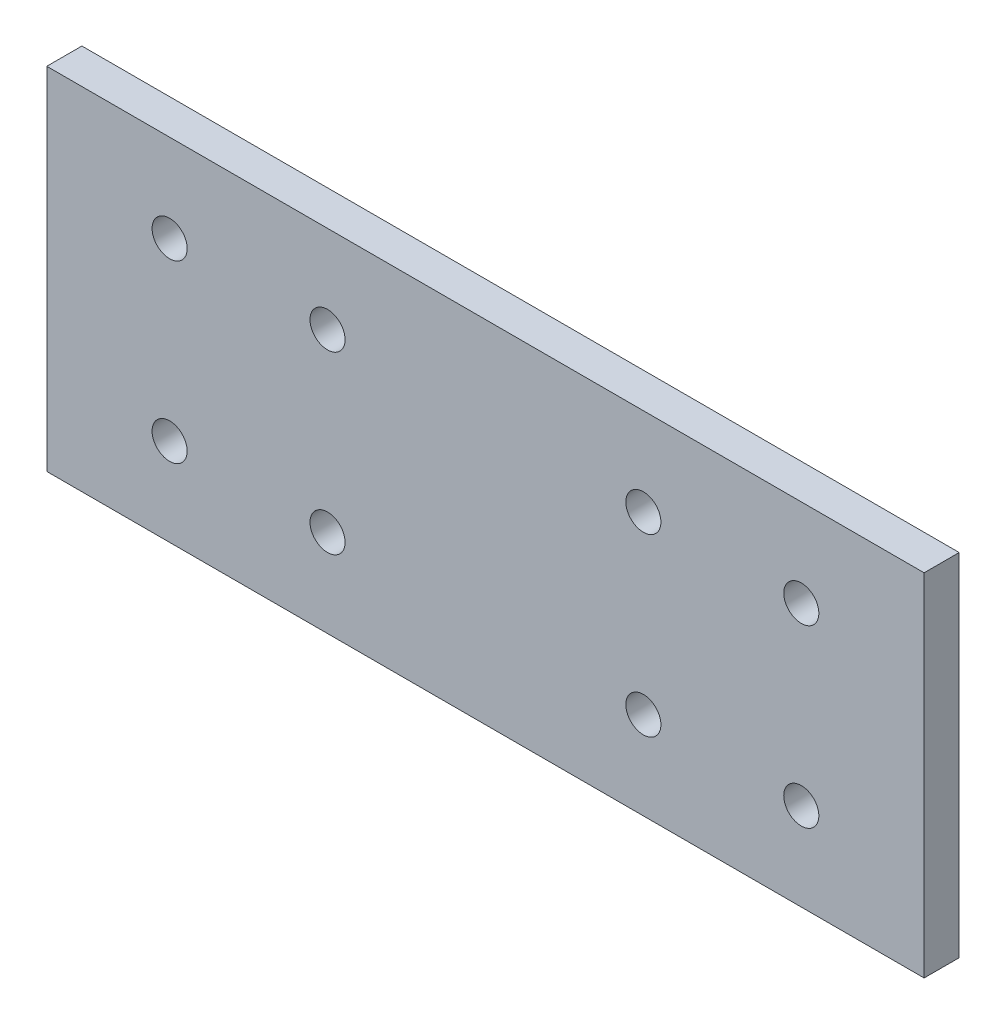
ISO-10303-21;
HEADER;
FILE_DESCRIPTION(('STEP AP214'),'2;1');
FILE_NAME('part.step','',(''),(''),'','','');
FILE_SCHEMA(('AUTOMOTIVE_DESIGN { 1 0 10303 214 1 1 1 1 }'));
ENDSEC;
DATA;
#1=APPLICATION_CONTEXT('core data for automotive mechanical design processes');
#2=APPLICATION_PROTOCOL_DEFINITION('international standard','automotive_design',2000,#1);
#3=PRODUCT_CONTEXT('',#1,'mechanical');
#4=PRODUCT('Part','Part','',(#3));
#5=PRODUCT_RELATED_PRODUCT_CATEGORY('part','',(#4));
#6=PRODUCT_DEFINITION_FORMATION('','',#4);
#7=PRODUCT_DEFINITION_CONTEXT('part definition',#1,'design');
#8=PRODUCT_DEFINITION('design','',#6,#7);
#9=PRODUCT_DEFINITION_SHAPE('','',#8);
#10=(LENGTH_UNIT() NAMED_UNIT(*) SI_UNIT(.MILLI.,.METRE.));
#11=(NAMED_UNIT(*) PLANE_ANGLE_UNIT() SI_UNIT($,.RADIAN.));
#12=(NAMED_UNIT(*) SI_UNIT($,.STERADIAN.) SOLID_ANGLE_UNIT());
#13=UNCERTAINTY_MEASURE_WITH_UNIT(LENGTH_MEASURE(1.E-05),#10,'distance_accuracy_value','');
#14=(GEOMETRIC_REPRESENTATION_CONTEXT(3) GLOBAL_UNCERTAINTY_ASSIGNED_CONTEXT((#13)) GLOBAL_UNIT_ASSIGNED_CONTEXT((#10,
#11,#12)) REPRESENTATION_CONTEXT('',''));
#15=CARTESIAN_POINT('',(0.,0.,0.));
#16=DIRECTION('',(0.,0.,1.));
#17=DIRECTION('',(1.,0.,0.));
#18=AXIS2_PLACEMENT_3D('',#15,#16,#17);
#19=CARTESIAN_POINT('',(0.,0.,0.));
#20=DIRECTION('',(0.,0.,1.));
#21=DIRECTION('',(1.,0.,0.));
#22=AXIS2_PLACEMENT_3D('',#19,#20,#21);
#23=PLANE('',#22);
#24=CARTESIAN_POINT('',(-180.,-50.,0.));
#25=DIRECTION('',(0.,0.,-1.));
#26=DIRECTION('',(0.,1.,0.));
#27=AXIS2_PLACEMENT_3D('',#24,#25,#26);
#28=CIRCLE('',#27,10.);
#29=CARTESIAN_POINT('',(-180.,-40.,0.));
#30=VERTEX_POINT('',#29);
#31=EDGE_CURVE('E103',#30,#30,#28,.F.);
#32=ORIENTED_EDGE('',*,*,#31,.T.);
#33=EDGE_LOOP('',(#32));
#34=FACE_BOUND('',#33,.T.);
#35=CARTESIAN_POINT('',(-90.,-50.,0.));
#36=DIRECTION('',(0.,0.,-1.));
#37=DIRECTION('',(0.,1.,0.));
#38=AXIS2_PLACEMENT_3D('',#35,#36,#37);
#39=CIRCLE('',#38,10.);
#40=CARTESIAN_POINT('',(-90.,-40.,0.));
#41=VERTEX_POINT('',#40);
#42=EDGE_CURVE('E107',#41,#41,#39,.F.);
#43=ORIENTED_EDGE('',*,*,#42,.T.);
#44=EDGE_LOOP('',(#43));
#45=FACE_BOUND('',#44,.T.);
#46=CARTESIAN_POINT('',(-180.,50.,0.));
#47=DIRECTION('',(0.,0.,-1.));
#48=DIRECTION('',(0.,1.,0.));
#49=AXIS2_PLACEMENT_3D('',#46,#47,#48);
#50=CIRCLE('',#49,10.);
#51=CARTESIAN_POINT('',(-180.,60.,0.));
#52=VERTEX_POINT('',#51);
#53=EDGE_CURVE('E110',#52,#52,#50,.F.);
#54=ORIENTED_EDGE('',*,*,#53,.T.);
#55=EDGE_LOOP('',(#54));
#56=FACE_BOUND('',#55,.T.);
#57=CARTESIAN_POINT('',(-90.,50.,0.));
#58=DIRECTION('',(0.,0.,-1.));
#59=DIRECTION('',(0.,1.,0.));
#60=AXIS2_PLACEMENT_3D('',#57,#58,#59);
#61=CIRCLE('',#60,10.);
#62=CARTESIAN_POINT('',(-90.,60.0000000000001,0.));
#63=VERTEX_POINT('',#62);
#64=EDGE_CURVE('E113',#63,#63,#61,.F.);
#65=ORIENTED_EDGE('',*,*,#64,.T.);
#66=EDGE_LOOP('',(#65));
#67=FACE_BOUND('',#66,.T.);
#68=CARTESIAN_POINT('',(90.,-50.,0.));
#69=DIRECTION('',(0.,0.,-1.));
#70=DIRECTION('',(-1.,0.,0.));
#71=AXIS2_PLACEMENT_3D('',#68,#69,#70);
#72=CIRCLE('',#71,9.99999999999999);
#73=CARTESIAN_POINT('',(80.,-50.,0.));
#74=VERTEX_POINT('',#73);
#75=EDGE_CURVE('E116',#74,#74,#72,.F.);
#76=ORIENTED_EDGE('',*,*,#75,.T.);
#77=EDGE_LOOP('',(#76));
#78=FACE_BOUND('',#77,.T.);
#79=CARTESIAN_POINT('',(180.,-50.,0.));
#80=DIRECTION('',(0.,0.,-1.));
#81=DIRECTION('',(-1.,0.,0.));
#82=AXIS2_PLACEMENT_3D('',#79,#80,#81);
#83=CIRCLE('',#82,9.99999999999999);
#84=CARTESIAN_POINT('',(170.,-50.,0.));
#85=VERTEX_POINT('',#84);
#86=EDGE_CURVE('E119',#85,#85,#83,.F.);
#87=ORIENTED_EDGE('',*,*,#86,.T.);
#88=EDGE_LOOP('',(#87));
#89=FACE_BOUND('',#88,.T.);
#90=CARTESIAN_POINT('',(90.,50.,0.));
#91=DIRECTION('',(0.,0.,-1.));
#92=DIRECTION('',(-1.,0.,0.));
#93=AXIS2_PLACEMENT_3D('',#90,#91,#92);
#94=CIRCLE('',#93,9.99999999999999);
#95=CARTESIAN_POINT('',(80.,50.,0.));
#96=VERTEX_POINT('',#95);
#97=EDGE_CURVE('E121',#96,#96,#94,.F.);
#98=ORIENTED_EDGE('',*,*,#97,.T.);
#99=EDGE_LOOP('',(#98));
#100=FACE_BOUND('',#99,.T.);
#101=CARTESIAN_POINT('',(180.,50.,0.));
#102=DIRECTION('',(0.,0.,-1.));
#103=DIRECTION('',(-1.,0.,0.));
#104=AXIS2_PLACEMENT_3D('',#101,#102,#103);
#105=CIRCLE('',#104,9.99999999999999);
#106=CARTESIAN_POINT('',(170.,50.,0.));
#107=VERTEX_POINT('',#106);
#108=EDGE_CURVE('E21',#107,#107,#105,.F.);
#109=ORIENTED_EDGE('',*,*,#108,.T.);
#110=EDGE_LOOP('',(#109));
#111=FACE_BOUND('',#110,.T.);
#112=DIRECTION('',(0.,1.,0.));
#113=VECTOR('',#112,1.);
#114=CARTESIAN_POINT('',(250.,100.,0.));
#115=LINE('',#114,#113);
#116=CARTESIAN_POINT('',(250.,-100.,0.));
#117=VERTEX_POINT('',#116);
#118=CARTESIAN_POINT('',(250.,100.,0.));
#119=VERTEX_POINT('',#118);
#120=EDGE_CURVE('E61',#117,#119,#115,.T.);
#121=ORIENTED_EDGE('',*,*,#120,.F.);
#122=DIRECTION('',(1.,0.,0.));
#123=VECTOR('',#122,1.);
#124=CARTESIAN_POINT('',(250.,-99.9999999999999,0.));
#125=LINE('',#124,#123);
#126=CARTESIAN_POINT('',(-250.,-100.,0.));
#127=VERTEX_POINT('',#126);
#128=EDGE_CURVE('E128',#127,#117,#125,.T.);
#129=ORIENTED_EDGE('',*,*,#128,.F.);
#130=DIRECTION('',(0.,1.,0.));
#131=VECTOR('',#130,1.);
#132=CARTESIAN_POINT('',(-250.,-100.,0.));
#133=LINE('',#132,#131);
#134=CARTESIAN_POINT('',(-250.,100.,0.));
#135=VERTEX_POINT('',#134);
#136=EDGE_CURVE('E71',#135,#127,#133,.F.);
#137=ORIENTED_EDGE('',*,*,#136,.F.);
#138=DIRECTION('',(1.,0.,0.));
#139=VECTOR('',#138,1.);
#140=CARTESIAN_POINT('',(-250.,100.,0.));
#141=LINE('',#140,#139);
#142=EDGE_CURVE('E56',#119,#135,#141,.F.);
#143=ORIENTED_EDGE('',*,*,#142,.F.);
#144=EDGE_LOOP('',(#121,#129,#137,#143));
#145=FACE_BOUND('',#144,.T.);
#146=ADVANCED_FACE('F17',(#34,#45,#56,#67,#78,#89,#100,#111,#145),#23,.F.);
#147=CARTESIAN_POINT('',(250.,100.,0.));
#148=DIRECTION('',(1.,0.,0.));
#149=DIRECTION('',(0.,0.,-1.));
#150=AXIS2_PLACEMENT_3D('',#147,#148,#149);
#151=PLANE('',#150);
#152=ORIENTED_EDGE('',*,*,#120,.T.);
#153=DIRECTION('',(0.,0.,1.));
#154=VECTOR('',#153,1.);
#155=CARTESIAN_POINT('',(250.,100.,0.));
#156=LINE('',#155,#154);
#157=CARTESIAN_POINT('',(250.,100.,20.));
#158=VERTEX_POINT('',#157);
#159=EDGE_CURVE('E63',#158,#119,#156,.F.);
#160=ORIENTED_EDGE('',*,*,#159,.F.);
#161=DIRECTION('',(0.,1.,0.));
#162=VECTOR('',#161,1.);
#163=CARTESIAN_POINT('',(250.,0.,20.));
#164=LINE('',#163,#162);
#165=CARTESIAN_POINT('',(250.,-100.,20.));
#166=VERTEX_POINT('',#165);
#167=EDGE_CURVE('E106',#166,#158,#164,.T.);
#168=ORIENTED_EDGE('',*,*,#167,.F.);
#169=DIRECTION('',(0.,0.,-1.));
#170=VECTOR('',#169,1.);
#171=CARTESIAN_POINT('',(250.,-99.9999999999999,0.));
#172=LINE('',#171,#170);
#173=EDGE_CURVE('E66',#117,#166,#172,.F.);
#174=ORIENTED_EDGE('',*,*,#173,.F.);
#175=EDGE_LOOP('',(#152,#160,#168,#174));
#176=FACE_BOUND('',#175,.T.);
#177=ADVANCED_FACE('F62',(#176),#151,.T.);
#178=CARTESIAN_POINT('',(-250.,100.,0.));
#179=DIRECTION('',(0.,1.,0.));
#180=DIRECTION('',(0.,0.,1.));
#181=AXIS2_PLACEMENT_3D('',#178,#179,#180);
#182=PLANE('',#181);
#183=ORIENTED_EDGE('',*,*,#142,.T.);
#184=DIRECTION('',(0.,0.,1.));
#185=VECTOR('',#184,1.);
#186=CARTESIAN_POINT('',(-250.,100.,0.));
#187=LINE('',#186,#185);
#188=CARTESIAN_POINT('',(-250.,100.,20.));
#189=VERTEX_POINT('',#188);
#190=EDGE_CURVE('E73',#189,#135,#187,.F.);
#191=ORIENTED_EDGE('',*,*,#190,.F.);
#192=DIRECTION('',(1.,0.,0.));
#193=VECTOR('',#192,1.);
#194=CARTESIAN_POINT('',(0.,100.,20.));
#195=LINE('',#194,#193);
#196=EDGE_CURVE('E77',#158,#189,#195,.F.);
#197=ORIENTED_EDGE('',*,*,#196,.F.);
#198=ORIENTED_EDGE('',*,*,#159,.T.);
#199=EDGE_LOOP('',(#183,#191,#197,#198));
#200=FACE_BOUND('',#199,.T.);
#201=ADVANCED_FACE('F75',(#200),#182,.T.);
#202=CARTESIAN_POINT('',(-250.,-100.,0.));
#203=DIRECTION('',(-1.,0.,0.));
#204=DIRECTION('',(0.,0.,1.));
#205=AXIS2_PLACEMENT_3D('',#202,#203,#204);
#206=PLANE('',#205);
#207=ORIENTED_EDGE('',*,*,#136,.T.);
#208=DIRECTION('',(0.,0.,-1.));
#209=VECTOR('',#208,1.);
#210=CARTESIAN_POINT('',(-250.,-99.9999999999999,0.));
#211=LINE('',#210,#209);
#212=CARTESIAN_POINT('',(-250.,-100.,20.));
#213=VERTEX_POINT('',#212);
#214=EDGE_CURVE('E36',#213,#127,#211,.T.);
#215=ORIENTED_EDGE('',*,*,#214,.F.);
#216=DIRECTION('',(0.,1.,0.));
#217=VECTOR('',#216,1.);
#218=CARTESIAN_POINT('',(-250.,0.,20.));
#219=LINE('',#218,#217);
#220=EDGE_CURVE('E139',#189,#213,#219,.F.);
#221=ORIENTED_EDGE('',*,*,#220,.F.);
#222=ORIENTED_EDGE('',*,*,#190,.T.);
#223=EDGE_LOOP('',(#207,#215,#221,#222));
#224=FACE_BOUND('',#223,.T.);
#225=ADVANCED_FACE('F137',(#224),#206,.T.);
#226=CARTESIAN_POINT('',(250.,-99.9999999999999,0.));
#227=DIRECTION('',(0.,-1.,0.));
#228=DIRECTION('',(0.,0.,-1.));
#229=AXIS2_PLACEMENT_3D('',#226,#227,#228);
#230=PLANE('',#229);
#231=ORIENTED_EDGE('',*,*,#128,.T.);
#232=ORIENTED_EDGE('',*,*,#173,.T.);
#233=DIRECTION('',(1.,0.,0.));
#234=VECTOR('',#233,1.);
#235=CARTESIAN_POINT('',(0.,-100.,20.));
#236=LINE('',#235,#234);
#237=EDGE_CURVE('E102',#213,#166,#236,.T.);
#238=ORIENTED_EDGE('',*,*,#237,.F.);
#239=ORIENTED_EDGE('',*,*,#214,.T.);
#240=EDGE_LOOP('',(#231,#232,#238,#239));
#241=FACE_BOUND('',#240,.T.);
#242=ADVANCED_FACE('F144',(#241),#230,.T.);
#243=CARTESIAN_POINT('',(180.,50.,20.));
#244=DIRECTION('',(0.,0.,-1.));
#245=DIRECTION('',(-1.,0.,0.));
#246=AXIS2_PLACEMENT_3D('',#243,#244,#245);
#247=CYLINDRICAL_SURFACE('',#246,9.99999999999999);
#248=ORIENTED_EDGE('',*,*,#108,.F.);
#249=EDGE_LOOP('',(#248));
#250=FACE_BOUND('',#249,.T.);
#251=CARTESIAN_POINT('',(180.,50.,20.));
#252=DIRECTION('',(0.,0.,-1.));
#253=DIRECTION('',(-1.,0.,0.));
#254=AXIS2_PLACEMENT_3D('',#251,#252,#253);
#255=CIRCLE('',#254,9.99999999999999);
#256=CARTESIAN_POINT('',(170.,50.,20.));
#257=VERTEX_POINT('',#256);
#258=EDGE_CURVE('E99',#257,#257,#255,.T.);
#259=ORIENTED_EDGE('',*,*,#258,.F.);
#260=EDGE_LOOP('',(#259));
#261=FACE_BOUND('',#260,.T.);
#262=ADVANCED_FACE('F146',(#250,#261),#247,.F.);
#263=CARTESIAN_POINT('',(90.,50.,20.));
#264=DIRECTION('',(0.,0.,-1.));
#265=DIRECTION('',(-1.,0.,0.));
#266=AXIS2_PLACEMENT_3D('',#263,#264,#265);
#267=CYLINDRICAL_SURFACE('',#266,9.99999999999999);
#268=ORIENTED_EDGE('',*,*,#97,.F.);
#269=EDGE_LOOP('',(#268));
#270=FACE_BOUND('',#269,.T.);
#271=CARTESIAN_POINT('',(90.,50.,20.));
#272=DIRECTION('',(0.,0.,-1.));
#273=DIRECTION('',(-1.,0.,0.));
#274=AXIS2_PLACEMENT_3D('',#271,#272,#273);
#275=CIRCLE('',#274,9.99999999999999);
#276=CARTESIAN_POINT('',(80.,50.,20.));
#277=VERTEX_POINT('',#276);
#278=EDGE_CURVE('E96',#277,#277,#275,.T.);
#279=ORIENTED_EDGE('',*,*,#278,.F.);
#280=EDGE_LOOP('',(#279));
#281=FACE_BOUND('',#280,.T.);
#282=ADVANCED_FACE('F153',(#270,#281),#267,.F.);
#283=CARTESIAN_POINT('',(180.,-50.,20.));
#284=DIRECTION('',(0.,0.,-1.));
#285=DIRECTION('',(-1.,0.,0.));
#286=AXIS2_PLACEMENT_3D('',#283,#284,#285);
#287=CYLINDRICAL_SURFACE('',#286,9.99999999999999);
#288=ORIENTED_EDGE('',*,*,#86,.F.);
#289=EDGE_LOOP('',(#288));
#290=FACE_BOUND('',#289,.T.);
#291=CARTESIAN_POINT('',(180.,-50.,20.));
#292=DIRECTION('',(0.,0.,-1.));
#293=DIRECTION('',(-1.,0.,0.));
#294=AXIS2_PLACEMENT_3D('',#291,#292,#293);
#295=CIRCLE('',#294,9.99999999999999);
#296=CARTESIAN_POINT('',(170.,-50.,20.));
#297=VERTEX_POINT('',#296);
#298=EDGE_CURVE('E93',#297,#297,#295,.T.);
#299=ORIENTED_EDGE('',*,*,#298,.F.);
#300=EDGE_LOOP('',(#299));
#301=FACE_BOUND('',#300,.T.);
#302=ADVANCED_FACE('F183',(#290,#301),#287,.F.);
#303=CARTESIAN_POINT('',(90.,-50.,20.));
#304=DIRECTION('',(0.,0.,-1.));
#305=DIRECTION('',(-1.,0.,0.));
#306=AXIS2_PLACEMENT_3D('',#303,#304,#305);
#307=CYLINDRICAL_SURFACE('',#306,9.99999999999999);
#308=ORIENTED_EDGE('',*,*,#75,.F.);
#309=EDGE_LOOP('',(#308));
#310=FACE_BOUND('',#309,.T.);
#311=CARTESIAN_POINT('',(90.,-50.,20.));
#312=DIRECTION('',(0.,0.,-1.));
#313=DIRECTION('',(-1.,0.,0.));
#314=AXIS2_PLACEMENT_3D('',#311,#312,#313);
#315=CIRCLE('',#314,9.99999999999999);
#316=CARTESIAN_POINT('',(80.,-50.,20.));
#317=VERTEX_POINT('',#316);
#318=EDGE_CURVE('E90',#317,#317,#315,.T.);
#319=ORIENTED_EDGE('',*,*,#318,.F.);
#320=EDGE_LOOP('',(#319));
#321=FACE_BOUND('',#320,.T.);
#322=ADVANCED_FACE('F189',(#310,#321),#307,.F.);
#323=CARTESIAN_POINT('',(-90.,50.,20.));
#324=DIRECTION('',(0.,0.,-1.));
#325=DIRECTION('',(0.,1.,0.));
#326=AXIS2_PLACEMENT_3D('',#323,#324,#325);
#327=CYLINDRICAL_SURFACE('',#326,10.);
#328=ORIENTED_EDGE('',*,*,#64,.F.);
#329=EDGE_LOOP('',(#328));
#330=FACE_BOUND('',#329,.T.);
#331=CARTESIAN_POINT('',(-90.,50.,20.));
#332=DIRECTION('',(0.,0.,-1.));
#333=DIRECTION('',(0.,1.,0.));
#334=AXIS2_PLACEMENT_3D('',#331,#332,#333);
#335=CIRCLE('',#334,10.);
#336=CARTESIAN_POINT('',(-90.,60.,20.));
#337=VERTEX_POINT('',#336);
#338=EDGE_CURVE('E87',#337,#337,#335,.T.);
#339=ORIENTED_EDGE('',*,*,#338,.F.);
#340=EDGE_LOOP('',(#339));
#341=FACE_BOUND('',#340,.T.);
#342=ADVANCED_FACE('F196',(#330,#341),#327,.F.);
#343=CARTESIAN_POINT('',(-180.,50.,20.));
#344=DIRECTION('',(0.,0.,-1.));
#345=DIRECTION('',(0.,1.,0.));
#346=AXIS2_PLACEMENT_3D('',#343,#344,#345);
#347=CYLINDRICAL_SURFACE('',#346,10.);
#348=ORIENTED_EDGE('',*,*,#53,.F.);
#349=EDGE_LOOP('',(#348));
#350=FACE_BOUND('',#349,.T.);
#351=CARTESIAN_POINT('',(-180.,50.,20.));
#352=DIRECTION('',(0.,0.,-1.));
#353=DIRECTION('',(0.,1.,0.));
#354=AXIS2_PLACEMENT_3D('',#351,#352,#353);
#355=CIRCLE('',#354,10.);
#356=CARTESIAN_POINT('',(-180.,60.,20.));
#357=VERTEX_POINT('',#356);
#358=EDGE_CURVE('E84',#357,#357,#355,.T.);
#359=ORIENTED_EDGE('',*,*,#358,.F.);
#360=EDGE_LOOP('',(#359));
#361=FACE_BOUND('',#360,.T.);
#362=ADVANCED_FACE('F200',(#350,#361),#347,.F.);
#363=CARTESIAN_POINT('',(-90.,-50.,20.));
#364=DIRECTION('',(0.,0.,-1.));
#365=DIRECTION('',(0.,1.,0.));
#366=AXIS2_PLACEMENT_3D('',#363,#364,#365);
#367=CYLINDRICAL_SURFACE('',#366,10.);
#368=ORIENTED_EDGE('',*,*,#42,.F.);
#369=EDGE_LOOP('',(#368));
#370=FACE_BOUND('',#369,.T.);
#371=CARTESIAN_POINT('',(-90.,-50.,20.));
#372=DIRECTION('',(0.,0.,-1.));
#373=DIRECTION('',(0.,1.,0.));
#374=AXIS2_PLACEMENT_3D('',#371,#372,#373);
#375=CIRCLE('',#374,10.);
#376=CARTESIAN_POINT('',(-90.,-40.,20.));
#377=VERTEX_POINT('',#376);
#378=EDGE_CURVE('E27',#377,#377,#375,.T.);
#379=ORIENTED_EDGE('',*,*,#378,.F.);
#380=EDGE_LOOP('',(#379));
#381=FACE_BOUND('',#380,.T.);
#382=ADVANCED_FACE('F163',(#370,#381),#367,.F.);
#383=CARTESIAN_POINT('',(-180.,-50.,20.));
#384=DIRECTION('',(0.,0.,-1.));
#385=DIRECTION('',(0.,1.,0.));
#386=AXIS2_PLACEMENT_3D('',#383,#384,#385);
#387=CYLINDRICAL_SURFACE('',#386,10.);
#388=ORIENTED_EDGE('',*,*,#31,.F.);
#389=EDGE_LOOP('',(#388));
#390=FACE_BOUND('',#389,.T.);
#391=CARTESIAN_POINT('',(-180.,-50.,20.));
#392=DIRECTION('',(0.,0.,-1.));
#393=DIRECTION('',(0.,1.,0.));
#394=AXIS2_PLACEMENT_3D('',#391,#392,#393);
#395=CIRCLE('',#394,10.);
#396=CARTESIAN_POINT('',(-180.,-40.,20.));
#397=VERTEX_POINT('',#396);
#398=EDGE_CURVE('E11',#397,#397,#395,.T.);
#399=ORIENTED_EDGE('',*,*,#398,.F.);
#400=EDGE_LOOP('',(#399));
#401=FACE_BOUND('',#400,.T.);
#402=ADVANCED_FACE('F19',(#390,#401),#387,.F.);
#403=CARTESIAN_POINT('',(0.,0.,20.));
#404=DIRECTION('',(0.,0.,1.));
#405=DIRECTION('',(1.,0.,0.));
#406=AXIS2_PLACEMENT_3D('',#403,#404,#405);
#407=PLANE('',#406);
#408=ORIENTED_EDGE('',*,*,#398,.T.);
#409=EDGE_LOOP('',(#408));
#410=FACE_BOUND('',#409,.T.);
#411=ORIENTED_EDGE('',*,*,#378,.T.);
#412=EDGE_LOOP('',(#411));
#413=FACE_BOUND('',#412,.T.);
#414=ORIENTED_EDGE('',*,*,#358,.T.);
#415=EDGE_LOOP('',(#414));
#416=FACE_BOUND('',#415,.T.);
#417=ORIENTED_EDGE('',*,*,#338,.T.);
#418=EDGE_LOOP('',(#417));
#419=FACE_BOUND('',#418,.T.);
#420=ORIENTED_EDGE('',*,*,#318,.T.);
#421=EDGE_LOOP('',(#420));
#422=FACE_BOUND('',#421,.T.);
#423=ORIENTED_EDGE('',*,*,#298,.T.);
#424=EDGE_LOOP('',(#423));
#425=FACE_BOUND('',#424,.T.);
#426=ORIENTED_EDGE('',*,*,#278,.T.);
#427=EDGE_LOOP('',(#426));
#428=FACE_BOUND('',#427,.T.);
#429=ORIENTED_EDGE('',*,*,#258,.T.);
#430=EDGE_LOOP('',(#429));
#431=FACE_BOUND('',#430,.T.);
#432=ORIENTED_EDGE('',*,*,#220,.T.);
#433=ORIENTED_EDGE('',*,*,#237,.T.);
#434=ORIENTED_EDGE('',*,*,#167,.T.);
#435=ORIENTED_EDGE('',*,*,#196,.T.);
#436=EDGE_LOOP('',(#432,#433,#434,#435));
#437=FACE_BOUND('',#436,.T.);
#438=ADVANCED_FACE('F142',(#410,#413,#416,#419,#422,#425,#428,#431,#437),#407,.T.);
#439=CLOSED_SHELL('',(#146,#177,#201,#225,#242,#262,#282,#302,#322,#342,#362,#382,#402,#438));
#440=MANIFOLD_SOLID_BREP('B1',#439);
#441=ADVANCED_BREP_SHAPE_REPRESENTATION('',(#18,#440),#14);
#442=SHAPE_DEFINITION_REPRESENTATION(#9,#441);
ENDSEC;
END-ISO-10303-21;
